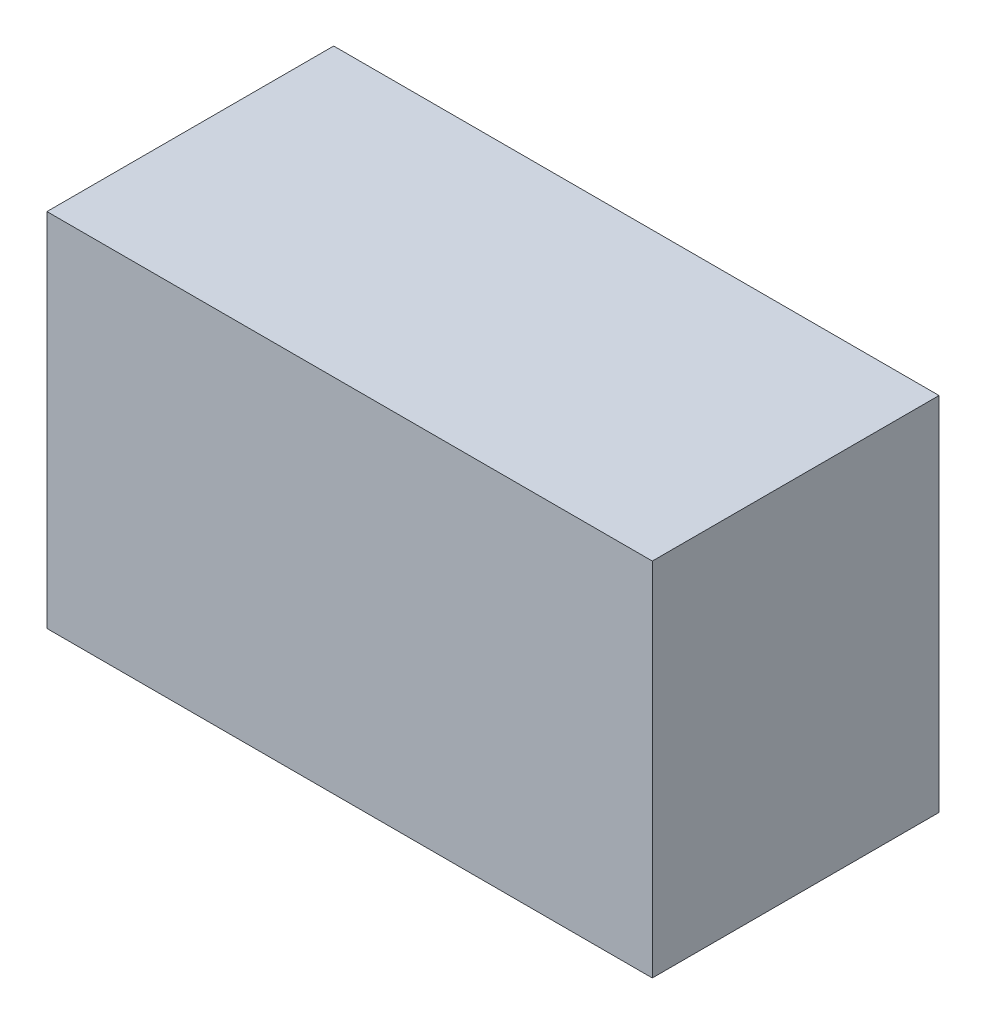
ISO-10303-21;
HEADER;
FILE_DESCRIPTION(('STEP AP214'),'2;1');
FILE_NAME('part.step','',(''),(''),'','','');
FILE_SCHEMA(('AUTOMOTIVE_DESIGN { 1 0 10303 214 1 1 1 1 }'));
ENDSEC;
DATA;
#1=APPLICATION_CONTEXT('core data for automotive mechanical design processes');
#2=APPLICATION_PROTOCOL_DEFINITION('international standard','automotive_design',2000,#1);
#3=PRODUCT_CONTEXT('',#1,'mechanical');
#4=PRODUCT('Part','Part','',(#3));
#5=PRODUCT_RELATED_PRODUCT_CATEGORY('part','',(#4));
#6=PRODUCT_DEFINITION_FORMATION('','',#4);
#7=PRODUCT_DEFINITION_CONTEXT('part definition',#1,'design');
#8=PRODUCT_DEFINITION('design','',#6,#7);
#9=PRODUCT_DEFINITION_SHAPE('','',#8);
#10=(LENGTH_UNIT() NAMED_UNIT(*) SI_UNIT(.MILLI.,.METRE.));
#11=(NAMED_UNIT(*) PLANE_ANGLE_UNIT() SI_UNIT($,.RADIAN.));
#12=(NAMED_UNIT(*) SI_UNIT($,.STERADIAN.) SOLID_ANGLE_UNIT());
#13=UNCERTAINTY_MEASURE_WITH_UNIT(LENGTH_MEASURE(1.E-05),#10,'distance_accuracy_value','');
#14=(GEOMETRIC_REPRESENTATION_CONTEXT(3) GLOBAL_UNCERTAINTY_ASSIGNED_CONTEXT((#13)) GLOBAL_UNIT_ASSIGNED_CONTEXT((#10,
#11,#12)) REPRESENTATION_CONTEXT('',''));
#15=CARTESIAN_POINT('',(0.,0.,0.));
#16=DIRECTION('',(0.,0.,1.));
#17=DIRECTION('',(1.,0.,0.));
#18=AXIS2_PLACEMENT_3D('',#15,#16,#17);
#19=CARTESIAN_POINT('',(-1.42499842,0.85000084,1.34999984));
#20=DIRECTION('',(0.,0.,-1.));
#21=DIRECTION('',(-1.,0.,0.));
#22=AXIS2_PLACEMENT_3D('',#19,#20,#21);
#23=PLANE('',#22);
#24=DIRECTION('',(1.,0.,0.));
#25=VECTOR('',#24,1.);
#26=CARTESIAN_POINT('',(-1.42499842,-0.8499983,1.34999984));
#27=LINE('',#26,#25);
#28=CARTESIAN_POINT('',(-1.42499842,-0.8499983,1.34999984));
#29=VERTEX_POINT('',#28);
#30=CARTESIAN_POINT('',(1.42500096,-0.8499983,1.34999984));
#31=VERTEX_POINT('',#30);
#32=EDGE_CURVE('E54',#29,#31,#27,.T.);
#33=ORIENTED_EDGE('',*,*,#32,.T.);
#34=DIRECTION('',(0.,1.,0.));
#35=VECTOR('',#34,1.);
#36=CARTESIAN_POINT('',(1.42500096,-0.8499983,1.34999984));
#37=LINE('',#36,#35);
#38=CARTESIAN_POINT('',(1.42500096,0.85000084,1.34999984));
#39=VERTEX_POINT('',#38);
#40=EDGE_CURVE('E57',#31,#39,#37,.T.);
#41=ORIENTED_EDGE('',*,*,#40,.T.);
#42=DIRECTION('',(1.,0.,0.));
#43=VECTOR('',#42,1.);
#44=CARTESIAN_POINT('',(1.42500096,0.85000084,1.34999984));
#45=LINE('',#44,#43);
#46=CARTESIAN_POINT('',(-1.42499842,0.85000084,1.34999984));
#47=VERTEX_POINT('',#46);
#48=EDGE_CURVE('E59',#39,#47,#45,.F.);
#49=ORIENTED_EDGE('',*,*,#48,.T.);
#50=DIRECTION('',(0.,1.,0.));
#51=VECTOR('',#50,1.);
#52=CARTESIAN_POINT('',(-1.42499842,0.85000084,1.34999984));
#53=LINE('',#52,#51);
#54=EDGE_CURVE('E19',#29,#47,#53,.T.);
#55=ORIENTED_EDGE('',*,*,#54,.F.);
#56=EDGE_LOOP('',(#33,#41,#49,#55));
#57=FACE_BOUND('',#56,.T.);
#58=ADVANCED_FACE('F16',(#57),#23,.F.);
#59=CARTESIAN_POINT('',(1.42500096,0.85000084,0.));
#60=DIRECTION('',(0.,-1.,0.));
#61=DIRECTION('',(0.,0.,-1.));
#62=AXIS2_PLACEMENT_3D('',#59,#60,#61);
#63=PLANE('',#62);
#64=DIRECTION('',(0.,0.,-1.));
#65=VECTOR('',#64,1.);
#66=CARTESIAN_POINT('',(-1.42499842,0.85000084,0.));
#67=LINE('',#66,#65);
#68=CARTESIAN_POINT('',(-1.42499842,0.85000084,0.));
#69=VERTEX_POINT('',#68);
#70=EDGE_CURVE('E70',#69,#47,#67,.F.);
#71=ORIENTED_EDGE('',*,*,#70,.T.);
#72=ORIENTED_EDGE('',*,*,#48,.F.);
#73=DIRECTION('',(0.,0.,1.));
#74=VECTOR('',#73,1.);
#75=CARTESIAN_POINT('',(1.42500096,0.85000084,0.));
#76=LINE('',#75,#74);
#77=CARTESIAN_POINT('',(1.42500096,0.85000084,0.));
#78=VERTEX_POINT('',#77);
#79=EDGE_CURVE('E64',#39,#78,#76,.F.);
#80=ORIENTED_EDGE('',*,*,#79,.T.);
#81=DIRECTION('',(-1.,0.,0.));
#82=VECTOR('',#81,1.);
#83=CARTESIAN_POINT('',(-1.42499842,0.85000084,0.));
#84=LINE('',#83,#82);
#85=EDGE_CURVE('E82',#69,#78,#84,.F.);
#86=ORIENTED_EDGE('',*,*,#85,.F.);
#87=EDGE_LOOP('',(#71,#72,#80,#86));
#88=FACE_BOUND('',#87,.T.);
#89=ADVANCED_FACE('F67',(#88),#63,.F.);
#90=CARTESIAN_POINT('',(1.42500096,-0.8499983,0.));
#91=DIRECTION('',(-1.,0.,0.));
#92=DIRECTION('',(0.,0.,1.));
#93=AXIS2_PLACEMENT_3D('',#90,#91,#92);
#94=PLANE('',#93);
#95=ORIENTED_EDGE('',*,*,#79,.F.);
#96=ORIENTED_EDGE('',*,*,#40,.F.);
#97=DIRECTION('',(0.,0.,1.));
#98=VECTOR('',#97,1.);
#99=CARTESIAN_POINT('',(1.42500096,-0.8499983,0.));
#100=LINE('',#99,#98);
#101=CARTESIAN_POINT('',(1.42500096,-0.8499983,0.));
#102=VERTEX_POINT('',#101);
#103=EDGE_CURVE('E76',#31,#102,#100,.F.);
#104=ORIENTED_EDGE('',*,*,#103,.T.);
#105=DIRECTION('',(0.,1.,0.));
#106=VECTOR('',#105,1.);
#107=CARTESIAN_POINT('',(1.42500096,0.85000084,0.));
#108=LINE('',#107,#106);
#109=EDGE_CURVE('E73',#78,#102,#108,.F.);
#110=ORIENTED_EDGE('',*,*,#109,.F.);
#111=EDGE_LOOP('',(#95,#96,#104,#110));
#112=FACE_BOUND('',#111,.T.);
#113=ADVANCED_FACE('F71',(#112),#94,.F.);
#114=CARTESIAN_POINT('',(-1.42499842,-0.8499983,0.));
#115=DIRECTION('',(0.,1.,0.));
#116=DIRECTION('',(0.,0.,1.));
#117=AXIS2_PLACEMENT_3D('',#114,#115,#116);
#118=PLANE('',#117);
#119=ORIENTED_EDGE('',*,*,#103,.F.);
#120=ORIENTED_EDGE('',*,*,#32,.F.);
#121=DIRECTION('',(0.,0.,-1.));
#122=VECTOR('',#121,1.);
#123=CARTESIAN_POINT('',(-1.42499842,-0.8499983,0.));
#124=LINE('',#123,#122);
#125=CARTESIAN_POINT('',(-1.42499842,-0.8499983,0.));
#126=VERTEX_POINT('',#125);
#127=EDGE_CURVE('E34',#29,#126,#124,.T.);
#128=ORIENTED_EDGE('',*,*,#127,.T.);
#129=DIRECTION('',(-1.,0.,0.));
#130=VECTOR('',#129,1.);
#131=CARTESIAN_POINT('',(-1.42499842,-0.8499983,0.));
#132=LINE('',#131,#130);
#133=EDGE_CURVE('E25',#102,#126,#132,.T.);
#134=ORIENTED_EDGE('',*,*,#133,.F.);
#135=EDGE_LOOP('',(#119,#120,#128,#134));
#136=FACE_BOUND('',#135,.T.);
#137=ADVANCED_FACE('F88',(#136),#118,.F.);
#138=CARTESIAN_POINT('',(-1.42499842,0.85000084,0.));
#139=DIRECTION('',(1.,0.,0.));
#140=DIRECTION('',(0.,0.,-1.));
#141=AXIS2_PLACEMENT_3D('',#138,#139,#140);
#142=PLANE('',#141);
#143=ORIENTED_EDGE('',*,*,#127,.F.);
#144=ORIENTED_EDGE('',*,*,#54,.T.);
#145=ORIENTED_EDGE('',*,*,#70,.F.);
#146=DIRECTION('',(0.,1.,0.));
#147=VECTOR('',#146,1.);
#148=CARTESIAN_POINT('',(-1.42499842,0.85000084,0.));
#149=LINE('',#148,#147);
#150=EDGE_CURVE('E11',#126,#69,#149,.T.);
#151=ORIENTED_EDGE('',*,*,#150,.F.);
#152=EDGE_LOOP('',(#143,#144,#145,#151));
#153=FACE_BOUND('',#152,.T.);
#154=ADVANCED_FACE('F90',(#153),#142,.F.);
#155=CARTESIAN_POINT('',(-1.42499842,0.85000084,0.));
#156=DIRECTION('',(0.,0.,-1.));
#157=DIRECTION('',(-1.,0.,0.));
#158=AXIS2_PLACEMENT_3D('',#155,#156,#157);
#159=PLANE('',#158);
#160=ORIENTED_EDGE('',*,*,#133,.T.);
#161=ORIENTED_EDGE('',*,*,#150,.T.);
#162=ORIENTED_EDGE('',*,*,#85,.T.);
#163=ORIENTED_EDGE('',*,*,#109,.T.);
#164=EDGE_LOOP('',(#160,#161,#162,#163));
#165=FACE_BOUND('',#164,.T.);
#166=ADVANCED_FACE('F87',(#165),#159,.T.);
#167=CLOSED_SHELL('',(#58,#89,#113,#137,#154,#166));
#168=MANIFOLD_SOLID_BREP('B1',#167);
#169=ADVANCED_BREP_SHAPE_REPRESENTATION('',(#18,#168),#14);
#170=SHAPE_DEFINITION_REPRESENTATION(#9,#169);
ENDSEC;
END-ISO-10303-21;
